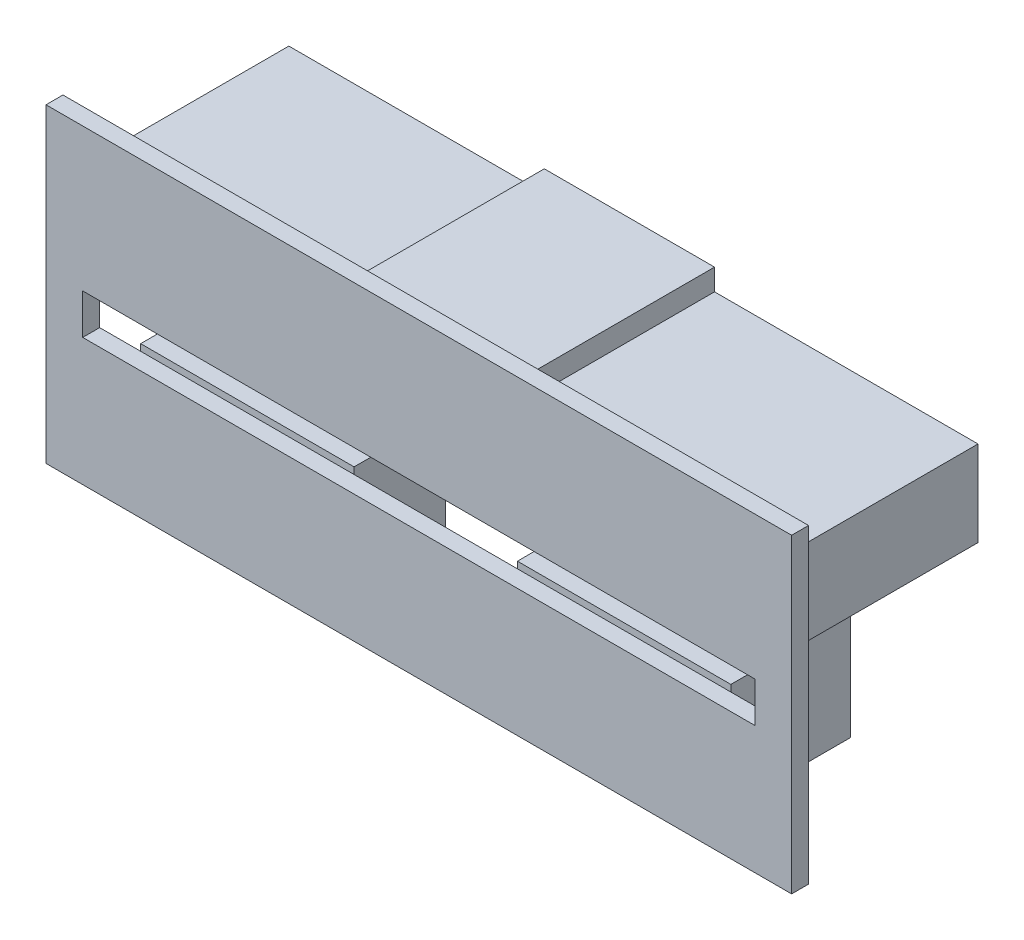
ISO-10303-21;
HEADER;
FILE_DESCRIPTION(('STEP AP214'),'2;1');
FILE_NAME('part.step','',(''),(''),'','','');
FILE_SCHEMA(('AUTOMOTIVE_DESIGN { 1 0 10303 214 1 1 1 1 }'));
ENDSEC;
DATA;
#1=APPLICATION_CONTEXT('core data for automotive mechanical design processes');
#2=APPLICATION_PROTOCOL_DEFINITION('international standard','automotive_design',2000,#1);
#3=PRODUCT_CONTEXT('',#1,'mechanical');
#4=PRODUCT('Part','Part','',(#3));
#5=PRODUCT_RELATED_PRODUCT_CATEGORY('part','',(#4));
#6=PRODUCT_DEFINITION_FORMATION('','',#4);
#7=PRODUCT_DEFINITION_CONTEXT('part definition',#1,'design');
#8=PRODUCT_DEFINITION('design','',#6,#7);
#9=PRODUCT_DEFINITION_SHAPE('','',#8);
#10=(LENGTH_UNIT() NAMED_UNIT(*) SI_UNIT(.MILLI.,.METRE.));
#11=(NAMED_UNIT(*) PLANE_ANGLE_UNIT() SI_UNIT($,.RADIAN.));
#12=(NAMED_UNIT(*) SI_UNIT($,.STERADIAN.) SOLID_ANGLE_UNIT());
#13=UNCERTAINTY_MEASURE_WITH_UNIT(LENGTH_MEASURE(1.E-05),#10,'distance_accuracy_value','');
#14=(GEOMETRIC_REPRESENTATION_CONTEXT(3) GLOBAL_UNCERTAINTY_ASSIGNED_CONTEXT((#13)) GLOBAL_UNIT_ASSIGNED_CONTEXT((#10,
#11,#12)) REPRESENTATION_CONTEXT('',''));
#15=CARTESIAN_POINT('',(0.,0.,0.));
#16=DIRECTION('',(0.,0.,1.));
#17=DIRECTION('',(1.,0.,0.));
#18=AXIS2_PLACEMENT_3D('',#15,#16,#17);
#19=CARTESIAN_POINT('',(0.,0.,0.));
#20=DIRECTION('',(0.,0.,-1.));
#21=DIRECTION('',(-1.,0.,0.));
#22=AXIS2_PLACEMENT_3D('',#19,#20,#21);
#23=PLANE('',#22);
#24=DIRECTION('',(0.,1.,0.));
#25=VECTOR('',#24,1.);
#26=CARTESIAN_POINT('',(26.404047634165,7.6,0.));
#27=LINE('',#26,#25);
#28=CARTESIAN_POINT('',(26.404047634165,-14.4,0.));
#29=VERTEX_POINT('',#28);
#30=CARTESIAN_POINT('',(26.404047634165,7.6,0.));
#31=VERTEX_POINT('',#30);
#32=EDGE_CURVE('E404',#29,#31,#27,.T.);
#33=ORIENTED_EDGE('',*,*,#32,.F.);
#34=DIRECTION('',(1.,0.,0.));
#35=VECTOR('',#34,1.);
#36=CARTESIAN_POINT('',(26.404047634165,-14.4,0.));
#37=LINE('',#36,#35);
#38=CARTESIAN_POINT('',(-26.404047634165,-14.4,0.));
#39=VERTEX_POINT('',#38);
#40=EDGE_CURVE('E409',#39,#29,#37,.T.);
#41=ORIENTED_EDGE('',*,*,#40,.F.);
#42=DIRECTION('',(0.,-1.,0.));
#43=VECTOR('',#42,1.);
#44=CARTESIAN_POINT('',(-26.404047634165,7.6,0.));
#45=LINE('',#44,#43);
#46=CARTESIAN_POINT('',(-26.404047634165,7.6,0.));
#47=VERTEX_POINT('',#46);
#48=EDGE_CURVE('E420',#47,#39,#45,.T.);
#49=ORIENTED_EDGE('',*,*,#48,.F.);
#50=DIRECTION('',(-1.,0.,0.));
#51=VECTOR('',#50,1.);
#52=CARTESIAN_POINT('',(26.404047634165,7.6,0.));
#53=LINE('',#52,#51);
#54=EDGE_CURVE('E418',#31,#47,#53,.T.);
#55=ORIENTED_EDGE('',*,*,#54,.F.);
#56=EDGE_LOOP('',(#33,#41,#49,#55));
#57=FACE_BOUND('',#56,.T.);
#58=DIRECTION('',(1.,0.,0.));
#59=VECTOR('',#58,1.);
#60=CARTESIAN_POINT('',(0.,-12.4,0.));
#61=LINE('',#60,#59);
#62=CARTESIAN_POINT('',(-20.9,-12.4,0.));
#63=VERTEX_POINT('',#62);
#64=CARTESIAN_POINT('',(-5.7882774694898,-12.4,0.));
#65=VERTEX_POINT('',#64);
#66=EDGE_CURVE('E70',#63,#65,#61,.T.);
#67=ORIENTED_EDGE('',*,*,#66,.T.);
#68=DIRECTION('',(0.,-1.,0.));
#69=VECTOR('',#68,1.);
#70=CARTESIAN_POINT('',(-5.7882774694898,12.4606349002454,0.));
#71=LINE('',#70,#69);
#72=CARTESIAN_POINT('',(-5.7882774694898,-5.36902364760776,0.));
#73=VERTEX_POINT('',#72);
#74=EDGE_CURVE('E362',#73,#65,#71,.T.);
#75=ORIENTED_EDGE('',*,*,#74,.F.);
#76=DIRECTION('',(1.,0.,0.));
#77=VECTOR('',#76,1.);
#78=CARTESIAN_POINT('',(23.8217606660417,-5.36902364760776,0.));
#79=LINE('',#78,#77);
#80=CARTESIAN_POINT('',(5.7882774694898,-5.36902364760776,0.));
#81=VERTEX_POINT('',#80);
#82=EDGE_CURVE('E394',#73,#81,#79,.T.);
#83=ORIENTED_EDGE('',*,*,#82,.T.);
#84=DIRECTION('',(0.,-1.,0.));
#85=VECTOR('',#84,1.);
#86=CARTESIAN_POINT('',(5.7882774694898,12.4606349002454,0.));
#87=LINE('',#86,#85);
#88=CARTESIAN_POINT('',(5.7882774694898,-12.4,0.));
#89=VERTEX_POINT('',#88);
#90=EDGE_CURVE('E457',#81,#89,#87,.T.);
#91=ORIENTED_EDGE('',*,*,#90,.T.);
#92=DIRECTION('',(1.,0.,0.));
#93=VECTOR('',#92,1.);
#94=CARTESIAN_POINT('',(0.,-12.4,0.));
#95=LINE('',#94,#93);
#96=CARTESIAN_POINT('',(20.9,-12.4,0.));
#97=VERTEX_POINT('',#96);
#98=EDGE_CURVE('E446',#89,#97,#95,.T.);
#99=ORIENTED_EDGE('',*,*,#98,.T.);
#100=DIRECTION('',(0.,-1.,0.));
#101=VECTOR('',#100,1.);
#102=CARTESIAN_POINT('',(20.9,12.4606349002454,0.));
#103=LINE('',#102,#101);
#104=CARTESIAN_POINT('',(20.9,-5.36902364760776,0.));
#105=VERTEX_POINT('',#104);
#106=EDGE_CURVE('E453',#105,#97,#103,.T.);
#107=ORIENTED_EDGE('',*,*,#106,.F.);
#108=CARTESIAN_POINT('',(23.8217606660417,-5.36902364760776,0.));
#109=VERTEX_POINT('',#108);
#110=EDGE_CURVE('E55',#105,#109,#79,.T.);
#111=ORIENTED_EDGE('',*,*,#110,.T.);
#112=DIRECTION('',(0.,1.,0.));
#113=VECTOR('',#112,1.);
#114=CARTESIAN_POINT('',(23.8217606660417,-2.51750136822422,0.));
#115=LINE('',#114,#113);
#116=CARTESIAN_POINT('',(23.8217606660417,-2.51750136822422,0.));
#117=VERTEX_POINT('',#116);
#118=EDGE_CURVE('E350',#109,#117,#115,.T.);
#119=ORIENTED_EDGE('',*,*,#118,.T.);
#120=DIRECTION('',(-1.,0.,0.));
#121=VECTOR('',#120,1.);
#122=CARTESIAN_POINT('',(23.8217606660417,-2.51750136822422,0.));
#123=LINE('',#122,#121);
#124=CARTESIAN_POINT('',(-23.8032716787454,-2.51750136822422,0.));
#125=VERTEX_POINT('',#124);
#126=EDGE_CURVE('E386',#117,#125,#123,.T.);
#127=ORIENTED_EDGE('',*,*,#126,.T.);
#128=DIRECTION('',(0.,-1.,0.));
#129=VECTOR('',#128,1.);
#130=CARTESIAN_POINT('',(-23.8032716787454,-2.51750136822422,0.));
#131=LINE('',#130,#129);
#132=CARTESIAN_POINT('',(-23.8032716787454,-5.36902364760776,0.));
#133=VERTEX_POINT('',#132);
#134=EDGE_CURVE('E389',#125,#133,#131,.T.);
#135=ORIENTED_EDGE('',*,*,#134,.T.);
#136=CARTESIAN_POINT('',(-20.9,-5.36902364760776,0.));
#137=VERTEX_POINT('',#136);
#138=EDGE_CURVE('E54',#133,#137,#79,.T.);
#139=ORIENTED_EDGE('',*,*,#138,.T.);
#140=DIRECTION('',(0.,-1.,0.));
#141=VECTOR('',#140,1.);
#142=CARTESIAN_POINT('',(-20.9,12.4606349002454,0.));
#143=LINE('',#142,#141);
#144=EDGE_CURVE('E366',#137,#63,#143,.T.);
#145=ORIENTED_EDGE('',*,*,#144,.T.);
#146=EDGE_LOOP('',(#67,#75,#83,#91,#99,#107,#111,#119,#127,#135,#139,#145));
#147=FACE_BOUND('',#146,.T.);
#148=DIRECTION('',(0.,-1.,0.));
#149=VECTOR('',#148,1.);
#150=CARTESIAN_POINT('',(5.74495861203088,0.,0.));
#151=LINE('',#150,#149);
#152=CARTESIAN_POINT('',(5.74495861203088,6.11749670647032,0.));
#153=VERTEX_POINT('',#152);
#154=CARTESIAN_POINT('',(5.74495861203089,4.6,0.));
#155=VERTEX_POINT('',#154);
#156=EDGE_CURVE('E266',#153,#155,#151,.T.);
#157=ORIENTED_EDGE('',*,*,#156,.F.);
#158=DIRECTION('',(1.,0.,0.));
#159=VECTOR('',#158,1.);
#160=CARTESIAN_POINT('',(0.,6.11749670647032,0.));
#161=LINE('',#160,#159);
#162=CARTESIAN_POINT('',(-6.31294046898743,6.11749670647032,0.));
#163=VERTEX_POINT('',#162);
#164=EDGE_CURVE('E291',#163,#153,#161,.T.);
#165=ORIENTED_EDGE('',*,*,#164,.F.);
#166=DIRECTION('',(0.,1.,0.));
#167=VECTOR('',#166,1.);
#168=CARTESIAN_POINT('',(-6.31294046898743,0.,0.));
#169=LINE('',#168,#167);
#170=CARTESIAN_POINT('',(-6.31294046898743,4.6,0.));
#171=VERTEX_POINT('',#170);
#172=EDGE_CURVE('E258',#171,#163,#169,.T.);
#173=ORIENTED_EDGE('',*,*,#172,.F.);
#174=DIRECTION('',(1.,0.,0.));
#175=VECTOR('',#174,1.);
#176=CARTESIAN_POINT('',(0.,4.6,0.));
#177=LINE('',#176,#175);
#178=CARTESIAN_POINT('',(-24.4040476341649,4.6,0.));
#179=VERTEX_POINT('',#178);
#180=EDGE_CURVE('E294',#179,#171,#177,.T.);
#181=ORIENTED_EDGE('',*,*,#180,.F.);
#182=DIRECTION('',(0.,1.,0.));
#183=VECTOR('',#182,1.);
#184=CARTESIAN_POINT('',(-24.404047634165,0.,0.));
#185=LINE('',#184,#183);
#186=CARTESIAN_POINT('',(-24.404047634165,-1.45245350387344,0.));
#187=VERTEX_POINT('',#186);
#188=EDGE_CURVE('E296',#187,#179,#185,.T.);
#189=ORIENTED_EDGE('',*,*,#188,.F.);
#190=DIRECTION('',(1.,0.,0.));
#191=VECTOR('',#190,1.);
#192=CARTESIAN_POINT('',(0.,-1.45245350387344,0.));
#193=LINE('',#192,#191);
#194=CARTESIAN_POINT('',(-22.804047634165,-1.45245350387344,0.));
#195=VERTEX_POINT('',#194);
#196=EDGE_CURVE('E298',#187,#195,#193,.T.);
#197=ORIENTED_EDGE('',*,*,#196,.T.);
#198=DIRECTION('',(0.,1.,0.));
#199=VECTOR('',#198,1.);
#200=CARTESIAN_POINT('',(-22.804047634165,0.,0.));
#201=LINE('',#200,#199);
#202=CARTESIAN_POINT('',(-22.804047634165,1.90240231752055,0.));
#203=VERTEX_POINT('',#202);
#204=EDGE_CURVE('E301',#195,#203,#201,.T.);
#205=ORIENTED_EDGE('',*,*,#204,.T.);
#206=DIRECTION('',(-1.,0.,0.));
#207=VECTOR('',#206,1.);
#208=CARTESIAN_POINT('',(0.,1.90240231752055,0.));
#209=LINE('',#208,#207);
#210=CARTESIAN_POINT('',(22.804047634165,1.90240231752055,0.));
#211=VERTEX_POINT('',#210);
#212=EDGE_CURVE('E304',#211,#203,#209,.T.);
#213=ORIENTED_EDGE('',*,*,#212,.F.);
#214=DIRECTION('',(0.,1.,0.));
#215=VECTOR('',#214,1.);
#216=CARTESIAN_POINT('',(22.804047634165,0.,0.));
#217=LINE('',#216,#215);
#218=CARTESIAN_POINT('',(22.804047634165,-1.45245350387344,0.));
#219=VERTEX_POINT('',#218);
#220=EDGE_CURVE('E307',#219,#211,#217,.T.);
#221=ORIENTED_EDGE('',*,*,#220,.F.);
#222=DIRECTION('',(-1.,0.,0.));
#223=VECTOR('',#222,1.);
#224=CARTESIAN_POINT('',(0.,-1.45245350387344,0.));
#225=LINE('',#224,#223);
#226=CARTESIAN_POINT('',(24.404047634165,-1.45245350387344,0.));
#227=VERTEX_POINT('',#226);
#228=EDGE_CURVE('E309',#227,#219,#225,.T.);
#229=ORIENTED_EDGE('',*,*,#228,.F.);
#230=DIRECTION('',(0.,-1.,0.));
#231=VECTOR('',#230,1.);
#232=CARTESIAN_POINT('',(24.404047634165,0.,0.));
#233=LINE('',#232,#231);
#234=CARTESIAN_POINT('',(24.404047634165,4.6,0.));
#235=VERTEX_POINT('',#234);
#236=EDGE_CURVE('E311',#235,#227,#233,.T.);
#237=ORIENTED_EDGE('',*,*,#236,.F.);
#238=DIRECTION('',(1.,0.,0.));
#239=VECTOR('',#238,1.);
#240=CARTESIAN_POINT('',(0.,4.6,0.));
#241=LINE('',#240,#239);
#242=EDGE_CURVE('E268',#155,#235,#241,.T.);
#243=ORIENTED_EDGE('',*,*,#242,.F.);
#244=EDGE_LOOP('',(#157,#165,#173,#181,#189,#197,#205,#213,#221,#229,#237,#243));
#245=FACE_BOUND('',#244,.T.);
#246=ADVANCED_FACE('F43',(#57,#147,#245),#23,.T.);
#247=CARTESIAN_POINT('',(0.,-12.4,0.));
#248=DIRECTION('',(0.,1.,0.));
#249=DIRECTION('',(0.,0.,1.));
#250=AXIS2_PLACEMENT_3D('',#247,#248,#249);
#251=PLANE('',#250);
#252=CARTESIAN_POINT('',(12.95,-12.4,-10.2));
#253=DIRECTION('',(0.,1.,0.));
#254=DIRECTION('',(0.,0.,1.));
#255=AXIS2_PLACEMENT_3D('',#252,#253,#254);
#256=CIRCLE('',#255,8.13636367644387);
#257=CARTESIAN_POINT('',(5.74495861203088,-12.4,-6.42008036156756));
#258=VERTEX_POINT('',#257);
#259=CARTESIAN_POINT('',(20.9,-12.4,-8.46855150947094));
#260=VERTEX_POINT('',#259);
#261=EDGE_CURVE('E434',#258,#260,#256,.T.);
#262=ORIENTED_EDGE('',*,*,#261,.T.);
#263=DIRECTION('',(0.,0.,-1.));
#264=VECTOR('',#263,1.);
#265=CARTESIAN_POINT('',(20.9,-12.4,0.));
#266=LINE('',#265,#264);
#267=EDGE_CURVE('E448',#97,#260,#266,.T.);
#268=ORIENTED_EDGE('',*,*,#267,.F.);
#269=ORIENTED_EDGE('',*,*,#98,.F.);
#270=DIRECTION('',(-0.00674724753508559,0.,-0.999977237066275));
#271=VECTOR('',#270,1.);
#272=CARTESIAN_POINT('',(5.78801395613616,-12.4,-0.0390540518833754));
#273=LINE('',#272,#271);
#274=EDGE_CURVE('E443',#89,#258,#273,.T.);
#275=ORIENTED_EDGE('',*,*,#274,.T.);
#276=EDGE_LOOP('',(#262,#268,#269,#275));
#277=FACE_BOUND('',#276,.T.);
#278=ADVANCED_FACE('F492',(#277),#251,.F.);
#279=CARTESIAN_POINT('',(20.9,12.4606349002454,0.));
#280=DIRECTION('',(-1.,0.,0.));
#281=DIRECTION('',(0.,0.,1.));
#282=AXIS2_PLACEMENT_3D('',#279,#280,#281);
#283=PLANE('',#282);
#284=DIRECTION('',(0.,-1.,0.));
#285=VECTOR('',#284,1.);
#286=CARTESIAN_POINT('',(20.9,12.4606349002454,-8.46855150947094));
#287=LINE('',#286,#285);
#288=CARTESIAN_POINT('',(20.9,-4.9,-8.46855150947094));
#289=VERTEX_POINT('',#288);
#290=EDGE_CURVE('E451',#289,#260,#287,.T.);
#291=ORIENTED_EDGE('',*,*,#290,.F.);
#292=DIRECTION('',(0.,0.,1.));
#293=VECTOR('',#292,1.);
#294=CARTESIAN_POINT('',(20.9,-4.9,0.));
#295=LINE('',#294,#293);
#296=CARTESIAN_POINT('',(20.9,-4.9,0.));
#297=VERTEX_POINT('',#296);
#298=EDGE_CURVE('E47',#289,#297,#295,.T.);
#299=ORIENTED_EDGE('',*,*,#298,.T.);
#300=EDGE_CURVE('E454',#297,#105,#103,.T.);
#301=ORIENTED_EDGE('',*,*,#300,.T.);
#302=ORIENTED_EDGE('',*,*,#106,.T.);
#303=ORIENTED_EDGE('',*,*,#267,.T.);
#304=EDGE_LOOP('',(#291,#299,#301,#302,#303));
#305=FACE_BOUND('',#304,.T.);
#306=ADVANCED_FACE('F469',(#305),#283,.F.);
#307=CARTESIAN_POINT('',(0.,12.4606349002454,0.));
#308=DIRECTION('',(0.,0.,-1.));
#309=DIRECTION('',(-1.,0.,0.));
#310=AXIS2_PLACEMENT_3D('',#307,#308,#309);
#311=PLANE('',#310);
#312=CARTESIAN_POINT('',(5.7882774694898,-4.9,0.));
#313=VERTEX_POINT('',#312);
#314=EDGE_CURVE('E458',#313,#81,#87,.T.);
#315=ORIENTED_EDGE('',*,*,#314,.T.);
#316=EDGE_CURVE('E11',#81,#105,#79,.T.);
#317=ORIENTED_EDGE('',*,*,#316,.T.);
#318=ORIENTED_EDGE('',*,*,#300,.F.);
#319=DIRECTION('',(-1.,0.,0.));
#320=VECTOR('',#319,1.);
#321=CARTESIAN_POINT('',(0.,-4.9,0.));
#322=LINE('',#321,#320);
#323=EDGE_CURVE('E435',#297,#313,#322,.T.);
#324=ORIENTED_EDGE('',*,*,#323,.T.);
#325=EDGE_LOOP('',(#315,#317,#318,#324));
#326=FACE_BOUND('',#325,.T.);
#327=ADVANCED_FACE('F480',(#326),#311,.F.);
#328=CARTESIAN_POINT('',(5.78801395613616,12.4606349002454,-0.0390540518833754));
#329=DIRECTION('',(-0.999977237066275,0.,0.00674724753508559));
#330=DIRECTION('',(0.00674724753508559,0.,0.999977237066275));
#331=AXIS2_PLACEMENT_3D('',#328,#329,#330);
#332=PLANE('',#331);
#333=DIRECTION('',(0.00674724753508559,0.,0.999977237066275));
#334=VECTOR('',#333,1.);
#335=CARTESIAN_POINT('',(5.78801395613616,-4.9,-0.0390540518833754));
#336=LINE('',#335,#334);
#337=CARTESIAN_POINT('',(5.74495861203088,-4.9,-6.42008036156756));
#338=VERTEX_POINT('',#337);
#339=EDGE_CURVE('E438',#338,#313,#336,.T.);
#340=ORIENTED_EDGE('',*,*,#339,.F.);
#341=DIRECTION('',(0.,-1.,0.));
#342=VECTOR('',#341,1.);
#343=CARTESIAN_POINT('',(5.74495861203088,12.4606349002454,-6.42008036156756));
#344=LINE('',#343,#342);
#345=EDGE_CURVE('E460',#338,#258,#344,.T.);
#346=ORIENTED_EDGE('',*,*,#345,.T.);
#347=ORIENTED_EDGE('',*,*,#274,.F.);
#348=ORIENTED_EDGE('',*,*,#90,.F.);
#349=ORIENTED_EDGE('',*,*,#314,.F.);
#350=EDGE_LOOP('',(#340,#346,#347,#348,#349));
#351=FACE_BOUND('',#350,.T.);
#352=ADVANCED_FACE('F477',(#351),#332,.T.);
#353=CARTESIAN_POINT('',(12.95,12.4606349002454,-10.2));
#354=DIRECTION('',(0.,-1.,0.));
#355=DIRECTION('',(0.,0.,-1.));
#356=AXIS2_PLACEMENT_3D('',#353,#354,#355);
#357=CYLINDRICAL_SURFACE('',#356,8.13636367644387);
#358=CARTESIAN_POINT('',(12.95,-4.9,-10.2));
#359=DIRECTION('',(0.,-1.,0.));
#360=DIRECTION('',(0.,0.,-1.));
#361=AXIS2_PLACEMENT_3D('',#358,#359,#360);
#362=CIRCLE('',#361,8.13636367644387);
#363=EDGE_CURVE('E52',#289,#338,#362,.T.);
#364=ORIENTED_EDGE('',*,*,#363,.F.);
#365=ORIENTED_EDGE('',*,*,#290,.T.);
#366=ORIENTED_EDGE('',*,*,#261,.F.);
#367=ORIENTED_EDGE('',*,*,#345,.F.);
#368=EDGE_LOOP('',(#364,#365,#366,#367));
#369=FACE_BOUND('',#368,.T.);
#370=ADVANCED_FACE('F45',(#369),#357,.F.);
#371=CARTESIAN_POINT('',(12.95,-4.9,-10.2));
#372=DIRECTION('',(0.,-1.,0.));
#373=DIRECTION('',(0.,0.,-1.));
#374=AXIS2_PLACEMENT_3D('',#371,#372,#373);
#375=PLANE('',#374);
#376=ORIENTED_EDGE('',*,*,#363,.T.);
#377=ORIENTED_EDGE('',*,*,#339,.T.);
#378=ORIENTED_EDGE('',*,*,#323,.F.);
#379=ORIENTED_EDGE('',*,*,#298,.F.);
#380=EDGE_LOOP('',(#376,#377,#378,#379));
#381=FACE_BOUND('',#380,.T.);
#382=ADVANCED_FACE('F474',(#381),#375,.F.);
#383=CARTESIAN_POINT('',(0.,0.,1.2));
#384=DIRECTION('',(0.,0.,-1.));
#385=DIRECTION('',(-1.,0.,0.));
#386=AXIS2_PLACEMENT_3D('',#383,#384,#385);
#387=PLANE('',#386);
#388=DIRECTION('',(0.,1.,0.));
#389=VECTOR('',#388,1.);
#390=CARTESIAN_POINT('',(26.404047634165,7.6,1.2));
#391=LINE('',#390,#389);
#392=CARTESIAN_POINT('',(26.404047634165,-14.4,1.2));
#393=VERTEX_POINT('',#392);
#394=CARTESIAN_POINT('',(26.404047634165,7.6,1.2));
#395=VERTEX_POINT('',#394);
#396=EDGE_CURVE('E405',#393,#395,#391,.T.);
#397=ORIENTED_EDGE('',*,*,#396,.T.);
#398=DIRECTION('',(-1.,0.,0.));
#399=VECTOR('',#398,1.);
#400=CARTESIAN_POINT('',(26.404047634165,7.6,1.2));
#401=LINE('',#400,#399);
#402=CARTESIAN_POINT('',(-26.404047634165,7.6,1.2));
#403=VERTEX_POINT('',#402);
#404=EDGE_CURVE('E408',#395,#403,#401,.T.);
#405=ORIENTED_EDGE('',*,*,#404,.T.);
#406=DIRECTION('',(0.,-1.,0.));
#407=VECTOR('',#406,1.);
#408=CARTESIAN_POINT('',(-26.404047634165,7.6,1.2));
#409=LINE('',#408,#407);
#410=CARTESIAN_POINT('',(-26.404047634165,-14.4,1.2));
#411=VERTEX_POINT('',#410);
#412=EDGE_CURVE('E411',#403,#411,#409,.T.);
#413=ORIENTED_EDGE('',*,*,#412,.T.);
#414=DIRECTION('',(1.,0.,0.));
#415=VECTOR('',#414,1.);
#416=CARTESIAN_POINT('',(26.404047634165,-14.4,1.2));
#417=LINE('',#416,#415);
#418=EDGE_CURVE('E413',#411,#393,#417,.T.);
#419=ORIENTED_EDGE('',*,*,#418,.T.);
#420=EDGE_LOOP('',(#397,#405,#413,#419));
#421=FACE_BOUND('',#420,.T.);
#422=DIRECTION('',(0.,1.,0.));
#423=VECTOR('',#422,1.);
#424=CARTESIAN_POINT('',(23.8217606660417,-2.51750136822422,1.2));
#425=LINE('',#424,#423);
#426=CARTESIAN_POINT('',(23.8217606660417,-5.36902364760776,1.2));
#427=VERTEX_POINT('',#426);
#428=CARTESIAN_POINT('',(23.8217606660417,-2.51750136822422,1.2));
#429=VERTEX_POINT('',#428);
#430=EDGE_CURVE('E374',#427,#429,#425,.T.);
#431=ORIENTED_EDGE('',*,*,#430,.F.);
#432=DIRECTION('',(1.,0.,0.));
#433=VECTOR('',#432,1.);
#434=CARTESIAN_POINT('',(23.8217606660417,-5.36902364760776,1.2));
#435=LINE('',#434,#433);
#436=CARTESIAN_POINT('',(-23.8032716787454,-5.36902364760776,1.2));
#437=VERTEX_POINT('',#436);
#438=EDGE_CURVE('E381',#437,#427,#435,.T.);
#439=ORIENTED_EDGE('',*,*,#438,.F.);
#440=DIRECTION('',(0.,-1.,0.));
#441=VECTOR('',#440,1.);
#442=CARTESIAN_POINT('',(-23.8032716787454,-2.51750136822422,1.2));
#443=LINE('',#442,#441);
#444=CARTESIAN_POINT('',(-23.8032716787454,-2.51750136822422,1.2));
#445=VERTEX_POINT('',#444);
#446=EDGE_CURVE('E378',#445,#437,#443,.T.);
#447=ORIENTED_EDGE('',*,*,#446,.F.);
#448=DIRECTION('',(-1.,0.,0.));
#449=VECTOR('',#448,1.);
#450=CARTESIAN_POINT('',(23.8217606660417,-2.51750136822422,1.2));
#451=LINE('',#450,#449);
#452=EDGE_CURVE('E376',#429,#445,#451,.T.);
#453=ORIENTED_EDGE('',*,*,#452,.F.);
#454=EDGE_LOOP('',(#431,#439,#447,#453));
#455=FACE_BOUND('',#454,.T.);
#456=ADVANCED_FACE('F514',(#421,#455),#387,.F.);
#457=CARTESIAN_POINT('',(26.404047634165,7.6,1.2));
#458=DIRECTION('',(-1.,0.,0.));
#459=DIRECTION('',(0.,0.,1.));
#460=AXIS2_PLACEMENT_3D('',#457,#458,#459);
#461=PLANE('',#460);
#462=ORIENTED_EDGE('',*,*,#32,.T.);
#463=DIRECTION('',(0.,0.,-1.));
#464=VECTOR('',#463,1.);
#465=CARTESIAN_POINT('',(26.404047634165,7.6,1.2));
#466=LINE('',#465,#464);
#467=EDGE_CURVE('E431',#395,#31,#466,.T.);
#468=ORIENTED_EDGE('',*,*,#467,.F.);
#469=ORIENTED_EDGE('',*,*,#396,.F.);
#470=DIRECTION('',(0.,0.,-1.));
#471=VECTOR('',#470,1.);
#472=CARTESIAN_POINT('',(26.404047634165,-14.4,1.2));
#473=LINE('',#472,#471);
#474=EDGE_CURVE('E415',#393,#29,#473,.T.);
#475=ORIENTED_EDGE('',*,*,#474,.T.);
#476=EDGE_LOOP('',(#462,#468,#469,#475));
#477=FACE_BOUND('',#476,.T.);
#478=ADVANCED_FACE('F517',(#477),#461,.F.);
#479=CARTESIAN_POINT('',(26.404047634165,7.6,1.2));
#480=DIRECTION('',(0.,-1.,0.));
#481=DIRECTION('',(0.,0.,-1.));
#482=AXIS2_PLACEMENT_3D('',#479,#480,#481);
#483=PLANE('',#482);
#484=ORIENTED_EDGE('',*,*,#54,.T.);
#485=DIRECTION('',(0.,0.,-1.));
#486=VECTOR('',#485,1.);
#487=CARTESIAN_POINT('',(-26.404047634165,7.6,1.2));
#488=LINE('',#487,#486);
#489=EDGE_CURVE('E428',#403,#47,#488,.T.);
#490=ORIENTED_EDGE('',*,*,#489,.F.);
#491=ORIENTED_EDGE('',*,*,#404,.F.);
#492=ORIENTED_EDGE('',*,*,#467,.T.);
#493=EDGE_LOOP('',(#484,#490,#491,#492));
#494=FACE_BOUND('',#493,.T.);
#495=ADVANCED_FACE('F523',(#494),#483,.F.);
#496=CARTESIAN_POINT('',(-26.404047634165,7.6,1.2));
#497=DIRECTION('',(1.,0.,0.));
#498=DIRECTION('',(0.,0.,-1.));
#499=AXIS2_PLACEMENT_3D('',#496,#497,#498);
#500=PLANE('',#499);
#501=ORIENTED_EDGE('',*,*,#48,.T.);
#502=DIRECTION('',(0.,0.,-1.));
#503=VECTOR('',#502,1.);
#504=CARTESIAN_POINT('',(-26.404047634165,-14.4,1.2));
#505=LINE('',#504,#503);
#506=EDGE_CURVE('E425',#411,#39,#505,.T.);
#507=ORIENTED_EDGE('',*,*,#506,.F.);
#508=ORIENTED_EDGE('',*,*,#412,.F.);
#509=ORIENTED_EDGE('',*,*,#489,.T.);
#510=EDGE_LOOP('',(#501,#507,#508,#509));
#511=FACE_BOUND('',#510,.T.);
#512=ADVANCED_FACE('F533',(#511),#500,.F.);
#513=CARTESIAN_POINT('',(26.404047634165,-14.4,1.2));
#514=DIRECTION('',(0.,1.,0.));
#515=DIRECTION('',(0.,0.,1.));
#516=AXIS2_PLACEMENT_3D('',#513,#514,#515);
#517=PLANE('',#516);
#518=ORIENTED_EDGE('',*,*,#40,.T.);
#519=ORIENTED_EDGE('',*,*,#474,.F.);
#520=ORIENTED_EDGE('',*,*,#418,.F.);
#521=ORIENTED_EDGE('',*,*,#506,.T.);
#522=EDGE_LOOP('',(#518,#519,#520,#521));
#523=FACE_BOUND('',#522,.T.);
#524=ADVANCED_FACE('F530',(#523),#517,.F.);
#525=CARTESIAN_POINT('',(23.8217606660417,-2.51750136822422,1.2));
#526=DIRECTION('',(-1.,0.,0.));
#527=DIRECTION('',(0.,0.,1.));
#528=AXIS2_PLACEMENT_3D('',#525,#526,#527);
#529=PLANE('',#528);
#530=ORIENTED_EDGE('',*,*,#118,.F.);
#531=DIRECTION('',(0.,0.,-1.));
#532=VECTOR('',#531,1.);
#533=CARTESIAN_POINT('',(23.8217606660417,-5.36902364760776,1.2));
#534=LINE('',#533,#532);
#535=EDGE_CURVE('E383',#427,#109,#534,.T.);
#536=ORIENTED_EDGE('',*,*,#535,.F.);
#537=ORIENTED_EDGE('',*,*,#430,.T.);
#538=DIRECTION('',(0.,0.,-1.));
#539=VECTOR('',#538,1.);
#540=CARTESIAN_POINT('',(23.8217606660417,-2.51750136822422,1.2));
#541=LINE('',#540,#539);
#542=EDGE_CURVE('E401',#429,#117,#541,.T.);
#543=ORIENTED_EDGE('',*,*,#542,.T.);
#544=EDGE_LOOP('',(#530,#536,#537,#543));
#545=FACE_BOUND('',#544,.T.);
#546=ADVANCED_FACE('F527',(#545),#529,.T.);
#547=CARTESIAN_POINT('',(23.8217606660417,-2.51750136822422,1.2));
#548=DIRECTION('',(0.,-1.,0.));
#549=DIRECTION('',(0.,0.,-1.));
#550=AXIS2_PLACEMENT_3D('',#547,#548,#549);
#551=PLANE('',#550);
#552=ORIENTED_EDGE('',*,*,#126,.F.);
#553=ORIENTED_EDGE('',*,*,#542,.F.);
#554=ORIENTED_EDGE('',*,*,#452,.T.);
#555=DIRECTION('',(0.,0.,-1.));
#556=VECTOR('',#555,1.);
#557=CARTESIAN_POINT('',(-23.8032716787454,-2.51750136822422,1.2));
#558=LINE('',#557,#556);
#559=EDGE_CURVE('E399',#445,#125,#558,.T.);
#560=ORIENTED_EDGE('',*,*,#559,.T.);
#561=EDGE_LOOP('',(#552,#553,#554,#560));
#562=FACE_BOUND('',#561,.T.);
#563=ADVANCED_FACE('F571',(#562),#551,.T.);
#564=CARTESIAN_POINT('',(-23.8032716787454,-2.51750136822422,1.2));
#565=DIRECTION('',(1.,0.,0.));
#566=DIRECTION('',(0.,0.,-1.));
#567=AXIS2_PLACEMENT_3D('',#564,#565,#566);
#568=PLANE('',#567);
#569=ORIENTED_EDGE('',*,*,#134,.F.);
#570=ORIENTED_EDGE('',*,*,#559,.F.);
#571=ORIENTED_EDGE('',*,*,#446,.T.);
#572=DIRECTION('',(0.,0.,-1.));
#573=VECTOR('',#572,1.);
#574=CARTESIAN_POINT('',(-23.8032716787454,-5.36902364760776,1.2));
#575=LINE('',#574,#573);
#576=EDGE_CURVE('E397',#437,#133,#575,.T.);
#577=ORIENTED_EDGE('',*,*,#576,.T.);
#578=EDGE_LOOP('',(#569,#570,#571,#577));
#579=FACE_BOUND('',#578,.T.);
#580=ADVANCED_FACE('F579',(#579),#568,.T.);
#581=CARTESIAN_POINT('',(23.8217606660417,-5.36902364760776,1.2));
#582=DIRECTION('',(0.,1.,0.));
#583=DIRECTION('',(0.,0.,1.));
#584=AXIS2_PLACEMENT_3D('',#581,#582,#583);
#585=PLANE('',#584);
#586=ORIENTED_EDGE('',*,*,#138,.F.);
#587=ORIENTED_EDGE('',*,*,#576,.F.);
#588=ORIENTED_EDGE('',*,*,#438,.T.);
#589=ORIENTED_EDGE('',*,*,#535,.T.);
#590=ORIENTED_EDGE('',*,*,#110,.F.);
#591=ORIENTED_EDGE('',*,*,#316,.F.);
#592=ORIENTED_EDGE('',*,*,#82,.F.);
#593=EDGE_CURVE('E393',#137,#73,#79,.T.);
#594=ORIENTED_EDGE('',*,*,#593,.F.);
#595=EDGE_LOOP('',(#586,#587,#588,#589,#590,#591,#592,#594));
#596=FACE_BOUND('',#595,.T.);
#597=ADVANCED_FACE('F484',(#596),#585,.T.);
#598=CARTESIAN_POINT('',(0.,-12.4,0.));
#599=DIRECTION('',(0.,1.,0.));
#600=DIRECTION('',(0.,0.,1.));
#601=AXIS2_PLACEMENT_3D('',#598,#599,#600);
#602=PLANE('',#601);
#603=CARTESIAN_POINT('',(-12.95,-12.4,-10.2));
#604=DIRECTION('',(0.,1.,0.));
#605=DIRECTION('',(0.,0.,1.));
#606=AXIS2_PLACEMENT_3D('',#603,#604,#605);
#607=CIRCLE('',#606,8.13636367644387);
#608=CARTESIAN_POINT('',(-20.9,-12.4,-8.46855150947094));
#609=VERTEX_POINT('',#608);
#610=CARTESIAN_POINT('',(-5.74495861203088,-12.4,-6.42008036156756));
#611=VERTEX_POINT('',#610);
#612=EDGE_CURVE('E315',#609,#611,#607,.T.);
#613=ORIENTED_EDGE('',*,*,#612,.T.);
#614=DIRECTION('',(0.00674724753508505,0.,-0.999977237066275));
#615=VECTOR('',#614,1.);
#616=CARTESIAN_POINT('',(-5.78801395613616,-12.4,-0.0390540518833722));
#617=LINE('',#616,#615);
#618=EDGE_CURVE('E357',#65,#611,#617,.T.);
#619=ORIENTED_EDGE('',*,*,#618,.F.);
#620=ORIENTED_EDGE('',*,*,#66,.F.);
#621=DIRECTION('',(0.,0.,1.));
#622=VECTOR('',#621,1.);
#623=CARTESIAN_POINT('',(-20.9,-12.4,0.));
#624=LINE('',#623,#622);
#625=EDGE_CURVE('E353',#609,#63,#624,.T.);
#626=ORIENTED_EDGE('',*,*,#625,.F.);
#627=EDGE_LOOP('',(#613,#619,#620,#626));
#628=FACE_BOUND('',#627,.T.);
#629=ADVANCED_FACE('F595',(#628),#602,.F.);
#630=CARTESIAN_POINT('',(-5.78801395613616,12.4606349002454,-0.0390540518833722));
#631=DIRECTION('',(-0.999977237066275,0.,-0.00674724753508504));
#632=DIRECTION('',(-0.00674724753508505,0.,0.999977237066275));
#633=AXIS2_PLACEMENT_3D('',#630,#631,#632);
#634=PLANE('',#633);
#635=DIRECTION('',(0.,-1.,0.));
#636=VECTOR('',#635,1.);
#637=CARTESIAN_POINT('',(-5.74495861203088,12.4606349002454,-6.42008036156756));
#638=LINE('',#637,#636);
#639=CARTESIAN_POINT('',(-5.74495861203088,-4.9,-6.42008036156756));
#640=VERTEX_POINT('',#639);
#641=EDGE_CURVE('E360',#640,#611,#638,.T.);
#642=ORIENTED_EDGE('',*,*,#641,.F.);
#643=DIRECTION('',(-0.00674724753508505,0.,0.999977237066275));
#644=VECTOR('',#643,1.);
#645=CARTESIAN_POINT('',(-5.78801395613616,-4.9,-0.0390540518833722));
#646=LINE('',#645,#644);
#647=CARTESIAN_POINT('',(-5.7882774694898,-4.9,0.));
#648=VERTEX_POINT('',#647);
#649=EDGE_CURVE('E345',#640,#648,#646,.T.);
#650=ORIENTED_EDGE('',*,*,#649,.T.);
#651=EDGE_CURVE('E363',#648,#73,#71,.T.);
#652=ORIENTED_EDGE('',*,*,#651,.T.);
#653=ORIENTED_EDGE('',*,*,#74,.T.);
#654=ORIENTED_EDGE('',*,*,#618,.T.);
#655=EDGE_LOOP('',(#642,#650,#652,#653,#654));
#656=FACE_BOUND('',#655,.T.);
#657=ADVANCED_FACE('F603',(#656),#634,.F.);
#658=CARTESIAN_POINT('',(0.,12.4606349002454,0.));
#659=DIRECTION('',(0.,0.,-1.));
#660=DIRECTION('',(-1.,0.,0.));
#661=AXIS2_PLACEMENT_3D('',#658,#659,#660);
#662=PLANE('',#661);
#663=ORIENTED_EDGE('',*,*,#593,.T.);
#664=ORIENTED_EDGE('',*,*,#651,.F.);
#665=DIRECTION('',(-1.,0.,0.));
#666=VECTOR('',#665,1.);
#667=CARTESIAN_POINT('',(0.,-4.9,0.));
#668=LINE('',#667,#666);
#669=CARTESIAN_POINT('',(-20.9,-4.9,0.));
#670=VERTEX_POINT('',#669);
#671=EDGE_CURVE('E341',#648,#670,#668,.T.);
#672=ORIENTED_EDGE('',*,*,#671,.T.);
#673=EDGE_CURVE('E367',#670,#137,#143,.T.);
#674=ORIENTED_EDGE('',*,*,#673,.T.);
#675=EDGE_LOOP('',(#663,#664,#672,#674));
#676=FACE_BOUND('',#675,.T.);
#677=ADVANCED_FACE('F612',(#676),#662,.F.);
#678=CARTESIAN_POINT('',(-20.9,12.4606349002454,0.));
#679=DIRECTION('',(1.,0.,0.));
#680=DIRECTION('',(0.,0.,-1.));
#681=AXIS2_PLACEMENT_3D('',#678,#679,#680);
#682=PLANE('',#681);
#683=ORIENTED_EDGE('',*,*,#673,.F.);
#684=DIRECTION('',(0.,0.,-1.));
#685=VECTOR('',#684,1.);
#686=CARTESIAN_POINT('',(-20.9,-4.9,0.));
#687=LINE('',#686,#685);
#688=CARTESIAN_POINT('',(-20.9,-4.9,-8.46855150947094));
#689=VERTEX_POINT('',#688);
#690=EDGE_CURVE('E344',#670,#689,#687,.T.);
#691=ORIENTED_EDGE('',*,*,#690,.T.);
#692=DIRECTION('',(0.,-1.,0.));
#693=VECTOR('',#692,1.);
#694=CARTESIAN_POINT('',(-20.9,12.4606349002454,-8.46855150947094));
#695=LINE('',#694,#693);
#696=EDGE_CURVE('E370',#689,#609,#695,.T.);
#697=ORIENTED_EDGE('',*,*,#696,.T.);
#698=ORIENTED_EDGE('',*,*,#625,.T.);
#699=ORIENTED_EDGE('',*,*,#144,.F.);
#700=EDGE_LOOP('',(#683,#691,#697,#698,#699));
#701=FACE_BOUND('',#700,.T.);
#702=ADVANCED_FACE('F620',(#701),#682,.F.);
#703=CARTESIAN_POINT('',(-12.95,12.4606349002454,-10.2));
#704=DIRECTION('',(0.,-1.,0.));
#705=DIRECTION('',(0.,0.,-1.));
#706=AXIS2_PLACEMENT_3D('',#703,#704,#705);
#707=CYLINDRICAL_SURFACE('',#706,8.13636367644387);
#708=CARTESIAN_POINT('',(-12.95,-4.9,-10.2));
#709=DIRECTION('',(0.,-1.,0.));
#710=DIRECTION('',(0.,0.,-1.));
#711=AXIS2_PLACEMENT_3D('',#708,#709,#710);
#712=CIRCLE('',#711,8.13636367644387);
#713=EDGE_CURVE('E348',#640,#689,#712,.T.);
#714=ORIENTED_EDGE('',*,*,#713,.F.);
#715=ORIENTED_EDGE('',*,*,#641,.T.);
#716=ORIENTED_EDGE('',*,*,#612,.F.);
#717=ORIENTED_EDGE('',*,*,#696,.F.);
#718=EDGE_LOOP('',(#714,#715,#716,#717));
#719=FACE_BOUND('',#718,.T.);
#720=ADVANCED_FACE('F628',(#719),#707,.F.);
#721=CARTESIAN_POINT('',(12.95,-4.9,-10.2));
#722=DIRECTION('',(0.,-1.,0.));
#723=DIRECTION('',(0.,0.,-1.));
#724=AXIS2_PLACEMENT_3D('',#721,#722,#723);
#725=PLANE('',#724);
#726=ORIENTED_EDGE('',*,*,#713,.T.);
#727=ORIENTED_EDGE('',*,*,#690,.F.);
#728=ORIENTED_EDGE('',*,*,#671,.F.);
#729=ORIENTED_EDGE('',*,*,#649,.F.);
#730=EDGE_LOOP('',(#726,#727,#728,#729));
#731=FACE_BOUND('',#730,.T.);
#732=ADVANCED_FACE('F636',(#731),#725,.F.);
#733=CARTESIAN_POINT('',(0.,6.11749670647032,-14.));
#734=DIRECTION('',(0.,-1.,0.));
#735=DIRECTION('',(0.,0.,-1.));
#736=AXIS2_PLACEMENT_3D('',#733,#734,#735);
#737=PLANE('',#736);
#738=ORIENTED_EDGE('',*,*,#164,.T.);
#739=DIRECTION('',(0.,0.,1.));
#740=VECTOR('',#739,1.);
#741=CARTESIAN_POINT('',(5.74495861203088,6.11749670647032,-14.));
#742=LINE('',#741,#740);
#743=CARTESIAN_POINT('',(5.74495861203088,6.11749670647032,-14.));
#744=VERTEX_POINT('',#743);
#745=EDGE_CURVE('E265',#744,#153,#742,.T.);
#746=ORIENTED_EDGE('',*,*,#745,.F.);
#747=DIRECTION('',(1.,0.,0.));
#748=VECTOR('',#747,1.);
#749=CARTESIAN_POINT('',(0.,6.11749670647032,-14.));
#750=LINE('',#749,#748);
#751=CARTESIAN_POINT('',(-6.31294046898743,6.11749670647032,-14.));
#752=VERTEX_POINT('',#751);
#753=EDGE_CURVE('E249',#752,#744,#750,.T.);
#754=ORIENTED_EDGE('',*,*,#753,.F.);
#755=DIRECTION('',(0.,0.,1.));
#756=VECTOR('',#755,1.);
#757=CARTESIAN_POINT('',(-6.31294046898743,6.11749670647032,-14.));
#758=LINE('',#757,#756);
#759=EDGE_CURVE('E255',#752,#163,#758,.T.);
#760=ORIENTED_EDGE('',*,*,#759,.T.);
#761=EDGE_LOOP('',(#738,#746,#754,#760));
#762=FACE_BOUND('',#761,.T.);
#763=ADVANCED_FACE('F264',(#762),#737,.F.);
#764=CARTESIAN_POINT('',(5.74495861203088,0.,-14.));
#765=DIRECTION('',(-1.,0.,0.));
#766=DIRECTION('',(0.,0.,1.));
#767=AXIS2_PLACEMENT_3D('',#764,#765,#766);
#768=PLANE('',#767);
#769=ORIENTED_EDGE('',*,*,#156,.T.);
#770=DIRECTION('',(0.,0.,1.));
#771=VECTOR('',#770,1.);
#772=CARTESIAN_POINT('',(5.74495861203089,4.6,-14.));
#773=LINE('',#772,#771);
#774=CARTESIAN_POINT('',(5.74495861203089,4.6,-14.));
#775=VERTEX_POINT('',#774);
#776=EDGE_CURVE('E316',#775,#155,#773,.T.);
#777=ORIENTED_EDGE('',*,*,#776,.F.);
#778=DIRECTION('',(0.,-1.,0.));
#779=VECTOR('',#778,1.);
#780=CARTESIAN_POINT('',(5.74495861203088,0.,-14.));
#781=LINE('',#780,#779);
#782=EDGE_CURVE('E262',#744,#775,#781,.T.);
#783=ORIENTED_EDGE('',*,*,#782,.F.);
#784=ORIENTED_EDGE('',*,*,#745,.T.);
#785=EDGE_LOOP('',(#769,#777,#783,#784));
#786=FACE_BOUND('',#785,.T.);
#787=ADVANCED_FACE('F651',(#786),#768,.F.);
#788=CARTESIAN_POINT('',(0.,4.6,-14.));
#789=DIRECTION('',(0.,-1.,0.));
#790=DIRECTION('',(0.,0.,-1.));
#791=AXIS2_PLACEMENT_3D('',#788,#789,#790);
#792=PLANE('',#791);
#793=ORIENTED_EDGE('',*,*,#242,.T.);
#794=DIRECTION('',(0.,0.,1.));
#795=VECTOR('',#794,1.);
#796=CARTESIAN_POINT('',(24.404047634165,4.6,-14.));
#797=LINE('',#796,#795);
#798=CARTESIAN_POINT('',(24.404047634165,4.6,-14.));
#799=VERTEX_POINT('',#798);
#800=EDGE_CURVE('E319',#799,#235,#797,.T.);
#801=ORIENTED_EDGE('',*,*,#800,.F.);
#802=DIRECTION('',(1.,0.,0.));
#803=VECTOR('',#802,1.);
#804=CARTESIAN_POINT('',(0.,4.6,-14.));
#805=LINE('',#804,#803);
#806=EDGE_CURVE('E288',#775,#799,#805,.T.);
#807=ORIENTED_EDGE('',*,*,#806,.F.);
#808=ORIENTED_EDGE('',*,*,#776,.T.);
#809=EDGE_LOOP('',(#793,#801,#807,#808));
#810=FACE_BOUND('',#809,.T.);
#811=ADVANCED_FACE('F658',(#810),#792,.F.);
#812=CARTESIAN_POINT('',(24.404047634165,0.,-14.));
#813=DIRECTION('',(-1.,0.,0.));
#814=DIRECTION('',(0.,0.,1.));
#815=AXIS2_PLACEMENT_3D('',#812,#813,#814);
#816=PLANE('',#815);
#817=ORIENTED_EDGE('',*,*,#236,.T.);
#818=DIRECTION('',(0.,0.,1.));
#819=VECTOR('',#818,1.);
#820=CARTESIAN_POINT('',(24.404047634165,-1.45245350387344,-14.));
#821=LINE('',#820,#819);
#822=CARTESIAN_POINT('',(24.404047634165,-1.45245350387344,-14.));
#823=VERTEX_POINT('',#822);
#824=EDGE_CURVE('E322',#823,#227,#821,.T.);
#825=ORIENTED_EDGE('',*,*,#824,.F.);
#826=DIRECTION('',(0.,-1.,0.));
#827=VECTOR('',#826,1.);
#828=CARTESIAN_POINT('',(24.404047634165,0.,-14.));
#829=LINE('',#828,#827);
#830=EDGE_CURVE('E286',#799,#823,#829,.T.);
#831=ORIENTED_EDGE('',*,*,#830,.F.);
#832=ORIENTED_EDGE('',*,*,#800,.T.);
#833=EDGE_LOOP('',(#817,#825,#831,#832));
#834=FACE_BOUND('',#833,.T.);
#835=ADVANCED_FACE('F666',(#834),#816,.F.);
#836=CARTESIAN_POINT('',(0.,-1.45245350387344,-14.));
#837=DIRECTION('',(0.,1.,0.));
#838=DIRECTION('',(0.,0.,1.));
#839=AXIS2_PLACEMENT_3D('',#836,#837,#838);
#840=PLANE('',#839);
#841=ORIENTED_EDGE('',*,*,#228,.T.);
#842=DIRECTION('',(0.,0.,1.));
#843=VECTOR('',#842,1.);
#844=CARTESIAN_POINT('',(22.804047634165,-1.45245350387344,-14.));
#845=LINE('',#844,#843);
#846=CARTESIAN_POINT('',(22.804047634165,-1.45245350387344,-14.));
#847=VERTEX_POINT('',#846);
#848=EDGE_CURVE('E325',#847,#219,#845,.T.);
#849=ORIENTED_EDGE('',*,*,#848,.F.);
#850=DIRECTION('',(-1.,0.,0.));
#851=VECTOR('',#850,1.);
#852=CARTESIAN_POINT('',(0.,-1.45245350387344,-14.));
#853=LINE('',#852,#851);
#854=EDGE_CURVE('E284',#823,#847,#853,.T.);
#855=ORIENTED_EDGE('',*,*,#854,.F.);
#856=ORIENTED_EDGE('',*,*,#824,.T.);
#857=EDGE_LOOP('',(#841,#849,#855,#856));
#858=FACE_BOUND('',#857,.T.);
#859=ADVANCED_FACE('F674',(#858),#840,.F.);
#860=CARTESIAN_POINT('',(22.804047634165,0.,-14.));
#861=DIRECTION('',(1.,0.,0.));
#862=DIRECTION('',(0.,0.,-1.));
#863=AXIS2_PLACEMENT_3D('',#860,#861,#862);
#864=PLANE('',#863);
#865=ORIENTED_EDGE('',*,*,#220,.T.);
#866=DIRECTION('',(0.,0.,1.));
#867=VECTOR('',#866,1.);
#868=CARTESIAN_POINT('',(22.804047634165,1.90240231752055,-14.));
#869=LINE('',#868,#867);
#870=CARTESIAN_POINT('',(22.804047634165,1.90240231752055,-14.));
#871=VERTEX_POINT('',#870);
#872=EDGE_CURVE('E328',#871,#211,#869,.T.);
#873=ORIENTED_EDGE('',*,*,#872,.F.);
#874=DIRECTION('',(0.,1.,0.));
#875=VECTOR('',#874,1.);
#876=CARTESIAN_POINT('',(22.804047634165,0.,-14.));
#877=LINE('',#876,#875);
#878=EDGE_CURVE('E282',#847,#871,#877,.T.);
#879=ORIENTED_EDGE('',*,*,#878,.F.);
#880=ORIENTED_EDGE('',*,*,#848,.T.);
#881=EDGE_LOOP('',(#865,#873,#879,#880));
#882=FACE_BOUND('',#881,.T.);
#883=ADVANCED_FACE('F682',(#882),#864,.F.);
#884=CARTESIAN_POINT('',(0.,1.90240231752055,-14.));
#885=DIRECTION('',(0.,1.,0.));
#886=DIRECTION('',(0.,0.,1.));
#887=AXIS2_PLACEMENT_3D('',#884,#885,#886);
#888=PLANE('',#887);
#889=ORIENTED_EDGE('',*,*,#212,.T.);
#890=DIRECTION('',(0.,0.,1.));
#891=VECTOR('',#890,1.);
#892=CARTESIAN_POINT('',(-22.804047634165,1.90240231752055,-14.));
#893=LINE('',#892,#891);
#894=CARTESIAN_POINT('',(-22.804047634165,1.90240231752055,-14.));
#895=VERTEX_POINT('',#894);
#896=EDGE_CURVE('E331',#895,#203,#893,.T.);
#897=ORIENTED_EDGE('',*,*,#896,.F.);
#898=DIRECTION('',(-1.,0.,0.));
#899=VECTOR('',#898,1.);
#900=CARTESIAN_POINT('',(0.,1.90240231752055,-14.));
#901=LINE('',#900,#899);
#902=EDGE_CURVE('E280',#871,#895,#901,.T.);
#903=ORIENTED_EDGE('',*,*,#902,.F.);
#904=ORIENTED_EDGE('',*,*,#872,.T.);
#905=EDGE_LOOP('',(#889,#897,#903,#904));
#906=FACE_BOUND('',#905,.T.);
#907=ADVANCED_FACE('F690',(#906),#888,.F.);
#908=CARTESIAN_POINT('',(-22.804047634165,0.,-14.));
#909=DIRECTION('',(1.,0.,0.));
#910=DIRECTION('',(0.,0.,-1.));
#911=AXIS2_PLACEMENT_3D('',#908,#909,#910);
#912=PLANE('',#911);
#913=ORIENTED_EDGE('',*,*,#204,.F.);
#914=DIRECTION('',(0.,0.,1.));
#915=VECTOR('',#914,1.);
#916=CARTESIAN_POINT('',(-22.804047634165,-1.45245350387344,-14.));
#917=LINE('',#916,#915);
#918=CARTESIAN_POINT('',(-22.804047634165,-1.45245350387344,-14.));
#919=VERTEX_POINT('',#918);
#920=EDGE_CURVE('E333',#919,#195,#917,.T.);
#921=ORIENTED_EDGE('',*,*,#920,.F.);
#922=DIRECTION('',(0.,1.,0.));
#923=VECTOR('',#922,1.);
#924=CARTESIAN_POINT('',(-22.804047634165,0.,-14.));
#925=LINE('',#924,#923);
#926=EDGE_CURVE('E277',#919,#895,#925,.T.);
#927=ORIENTED_EDGE('',*,*,#926,.T.);
#928=ORIENTED_EDGE('',*,*,#896,.T.);
#929=EDGE_LOOP('',(#913,#921,#927,#928));
#930=FACE_BOUND('',#929,.T.);
#931=ADVANCED_FACE('F698',(#930),#912,.T.);
#932=CARTESIAN_POINT('',(0.,-1.45245350387344,-14.));
#933=DIRECTION('',(0.,-1.,0.));
#934=DIRECTION('',(0.,0.,-1.));
#935=AXIS2_PLACEMENT_3D('',#932,#933,#934);
#936=PLANE('',#935);
#937=ORIENTED_EDGE('',*,*,#196,.F.);
#938=DIRECTION('',(0.,0.,1.));
#939=VECTOR('',#938,1.);
#940=CARTESIAN_POINT('',(-24.404047634165,-1.45245350387344,-14.));
#941=LINE('',#940,#939);
#942=CARTESIAN_POINT('',(-24.404047634165,-1.45245350387344,-14.));
#943=VERTEX_POINT('',#942);
#944=EDGE_CURVE('E335',#943,#187,#941,.T.);
#945=ORIENTED_EDGE('',*,*,#944,.F.);
#946=DIRECTION('',(1.,0.,0.));
#947=VECTOR('',#946,1.);
#948=CARTESIAN_POINT('',(0.,-1.45245350387344,-14.));
#949=LINE('',#948,#947);
#950=EDGE_CURVE('E274',#943,#919,#949,.T.);
#951=ORIENTED_EDGE('',*,*,#950,.T.);
#952=ORIENTED_EDGE('',*,*,#920,.T.);
#953=EDGE_LOOP('',(#937,#945,#951,#952));
#954=FACE_BOUND('',#953,.T.);
#955=ADVANCED_FACE('F706',(#954),#936,.T.);
#956=CARTESIAN_POINT('',(-24.404047634165,0.,-14.));
#957=DIRECTION('',(1.,0.,0.));
#958=DIRECTION('',(0.,0.,-1.));
#959=AXIS2_PLACEMENT_3D('',#956,#957,#958);
#960=PLANE('',#959);
#961=ORIENTED_EDGE('',*,*,#188,.T.);
#962=DIRECTION('',(0.,0.,1.));
#963=VECTOR('',#962,1.);
#964=CARTESIAN_POINT('',(-24.4040476341649,4.6,-14.));
#965=LINE('',#964,#963);
#966=CARTESIAN_POINT('',(-24.4040476341649,4.6,-14.));
#967=VERTEX_POINT('',#966);
#968=EDGE_CURVE('E337',#967,#179,#965,.T.);
#969=ORIENTED_EDGE('',*,*,#968,.F.);
#970=DIRECTION('',(0.,1.,0.));
#971=VECTOR('',#970,1.);
#972=CARTESIAN_POINT('',(-24.404047634165,0.,-14.));
#973=LINE('',#972,#971);
#974=EDGE_CURVE('E272',#943,#967,#973,.T.);
#975=ORIENTED_EDGE('',*,*,#974,.F.);
#976=ORIENTED_EDGE('',*,*,#944,.T.);
#977=EDGE_LOOP('',(#961,#969,#975,#976));
#978=FACE_BOUND('',#977,.T.);
#979=ADVANCED_FACE('F714',(#978),#960,.F.);
#980=CARTESIAN_POINT('',(0.,4.6,-14.));
#981=DIRECTION('',(0.,-1.,0.));
#982=DIRECTION('',(0.,0.,-1.));
#983=AXIS2_PLACEMENT_3D('',#980,#981,#982);
#984=PLANE('',#983);
#985=ORIENTED_EDGE('',*,*,#180,.T.);
#986=DIRECTION('',(0.,0.,1.));
#987=VECTOR('',#986,1.);
#988=CARTESIAN_POINT('',(-6.31294046898743,4.6,-14.));
#989=LINE('',#988,#987);
#990=CARTESIAN_POINT('',(-6.31294046898743,4.6,-14.));
#991=VERTEX_POINT('',#990);
#992=EDGE_CURVE('E62',#991,#171,#989,.T.);
#993=ORIENTED_EDGE('',*,*,#992,.F.);
#994=DIRECTION('',(1.,0.,0.));
#995=VECTOR('',#994,1.);
#996=CARTESIAN_POINT('',(0.,4.6,-14.));
#997=LINE('',#996,#995);
#998=EDGE_CURVE('E252',#967,#991,#997,.T.);
#999=ORIENTED_EDGE('',*,*,#998,.F.);
#1000=ORIENTED_EDGE('',*,*,#968,.T.);
#1001=EDGE_LOOP('',(#985,#993,#999,#1000));
#1002=FACE_BOUND('',#1001,.T.);
#1003=ADVANCED_FACE('F722',(#1002),#984,.F.);
#1004=CARTESIAN_POINT('',(-6.31294046898743,0.,-14.));
#1005=DIRECTION('',(1.,0.,0.));
#1006=DIRECTION('',(0.,0.,-1.));
#1007=AXIS2_PLACEMENT_3D('',#1004,#1005,#1006);
#1008=PLANE('',#1007);
#1009=ORIENTED_EDGE('',*,*,#172,.T.);
#1010=ORIENTED_EDGE('',*,*,#759,.F.);
#1011=DIRECTION('',(0.,1.,0.));
#1012=VECTOR('',#1011,1.);
#1013=CARTESIAN_POINT('',(-6.31294046898743,0.,-14.));
#1014=LINE('',#1013,#1012);
#1015=EDGE_CURVE('E245',#991,#752,#1014,.T.);
#1016=ORIENTED_EDGE('',*,*,#1015,.F.);
#1017=ORIENTED_EDGE('',*,*,#992,.T.);
#1018=EDGE_LOOP('',(#1009,#1010,#1016,#1017));
#1019=FACE_BOUND('',#1018,.T.);
#1020=ADVANCED_FACE('F256',(#1019),#1008,.F.);
#1021=CARTESIAN_POINT('',(0.,0.,-14.));
#1022=DIRECTION('',(0.,0.,1.));
#1023=DIRECTION('',(1.,0.,0.));
#1024=AXIS2_PLACEMENT_3D('',#1021,#1022,#1023);
#1025=PLANE('',#1024);
#1026=ORIENTED_EDGE('',*,*,#753,.T.);
#1027=ORIENTED_EDGE('',*,*,#782,.T.);
#1028=ORIENTED_EDGE('',*,*,#806,.T.);
#1029=ORIENTED_EDGE('',*,*,#830,.T.);
#1030=ORIENTED_EDGE('',*,*,#854,.T.);
#1031=ORIENTED_EDGE('',*,*,#878,.T.);
#1032=ORIENTED_EDGE('',*,*,#902,.T.);
#1033=ORIENTED_EDGE('',*,*,#926,.F.);
#1034=ORIENTED_EDGE('',*,*,#950,.F.);
#1035=ORIENTED_EDGE('',*,*,#974,.T.);
#1036=ORIENTED_EDGE('',*,*,#998,.T.);
#1037=ORIENTED_EDGE('',*,*,#1015,.T.);
#1038=EDGE_LOOP('',(#1026,#1027,#1028,#1029,#1030,#1031,#1032,#1033,#1034,#1035,#1036,#1037));
#1039=FACE_BOUND('',#1038,.T.);
#1040=ADVANCED_FACE('F247',(#1039),#1025,.F.);
#1041=CLOSED_SHELL('',(#246,#278,#306,#327,#352,#370,#382,#456,#478,#495,#512,#524,#546,#563,
#580,#597,#629,#657,#677,#702,#720,#732,#763,#787,#811,#835,#859,#883,#907,#931,#955,#979,#1003,
#1020,#1040));
#1042=MANIFOLD_SOLID_BREP('B2',#1041);
#1043=ADVANCED_BREP_SHAPE_REPRESENTATION('',(#18,#1042),#14);
#1044=SHAPE_DEFINITION_REPRESENTATION(#9,#1043);
ENDSEC;
END-ISO-10303-21;
